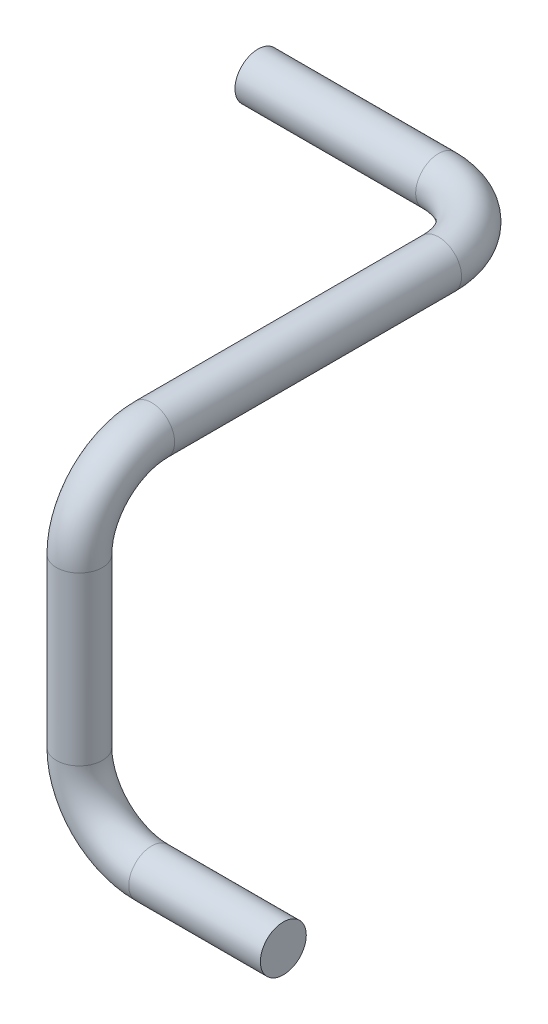
ISO-10303-21;
HEADER;
FILE_DESCRIPTION(('STEP AP214'),'2;1');
FILE_NAME('part.step','',(''),(''),'','','');
FILE_SCHEMA(('AUTOMOTIVE_DESIGN { 1 0 10303 214 1 1 1 1 }'));
ENDSEC;
DATA;
#1=APPLICATION_CONTEXT('core data for automotive mechanical design processes');
#2=APPLICATION_PROTOCOL_DEFINITION('international standard','automotive_design',2000,#1);
#3=PRODUCT_CONTEXT('',#1,'mechanical');
#4=PRODUCT('Part','Part','',(#3));
#5=PRODUCT_RELATED_PRODUCT_CATEGORY('part','',(#4));
#6=PRODUCT_DEFINITION_FORMATION('','',#4);
#7=PRODUCT_DEFINITION_CONTEXT('part definition',#1,'design');
#8=PRODUCT_DEFINITION('design','',#6,#7);
#9=PRODUCT_DEFINITION_SHAPE('','',#8);
#10=(LENGTH_UNIT() NAMED_UNIT(*) SI_UNIT(.MILLI.,.METRE.));
#11=(NAMED_UNIT(*) PLANE_ANGLE_UNIT() SI_UNIT($,.RADIAN.));
#12=(NAMED_UNIT(*) SI_UNIT($,.STERADIAN.) SOLID_ANGLE_UNIT());
#13=UNCERTAINTY_MEASURE_WITH_UNIT(LENGTH_MEASURE(1.E-05),#10,'distance_accuracy_value','');
#14=(GEOMETRIC_REPRESENTATION_CONTEXT(3) GLOBAL_UNCERTAINTY_ASSIGNED_CONTEXT((#13)) GLOBAL_UNIT_ASSIGNED_CONTEXT((#10,
#11,#12)) REPRESENTATION_CONTEXT('',''));
#15=CARTESIAN_POINT('',(0.,0.,0.));
#16=DIRECTION('',(0.,0.,1.));
#17=DIRECTION('',(1.,0.,0.));
#18=AXIS2_PLACEMENT_3D('',#15,#16,#17);
#19=CARTESIAN_POINT('',(70.,0.,20.));
#20=DIRECTION('',(0.,0.,1.));
#21=DIRECTION('',(1.,0.,0.));
#22=AXIS2_PLACEMENT_3D('',#19,#20,#21);
#23=CYLINDRICAL_SURFACE('',#22,6.35);
#24=CARTESIAN_POINT('',(70.,0.,20.));
#25=DIRECTION('',(0.,0.,1.));
#26=DIRECTION('',(1.,0.,0.));
#27=AXIS2_PLACEMENT_3D('',#24,#25,#26);
#28=CIRCLE('',#27,6.35);
#29=CARTESIAN_POINT('',(76.35,0.,20.));
#30=VERTEX_POINT('',#29);
#31=EDGE_CURVE('E10',#30,#30,#28,.T.);
#32=ORIENTED_EDGE('',*,*,#31,.T.);
#33=EDGE_LOOP('',(#32));
#34=FACE_BOUND('',#33,.T.);
#35=CARTESIAN_POINT('',(70.,0.,99.3877878972387));
#36=DIRECTION('',(0.,0.,1.));
#37=DIRECTION('',(1.,0.,0.));
#38=AXIS2_PLACEMENT_3D('',#35,#36,#37);
#39=CIRCLE('',#38,6.35);
#40=CARTESIAN_POINT('',(70.,6.35,99.3877878972387));
#41=VERTEX_POINT('',#40);
#42=EDGE_CURVE('E50',#41,#41,#39,.T.);
#43=ORIENTED_EDGE('',*,*,#42,.F.);
#44=EDGE_LOOP('',(#43));
#45=FACE_BOUND('',#44,.T.);
#46=ADVANCED_FACE('F31',(#34,#45),#23,.T.);
#47=CARTESIAN_POINT('',(50.,0.,20.));
#48=DIRECTION('',(0.,-1.,0.));
#49=DIRECTION('',(0.,0.,-1.));
#50=AXIS2_PLACEMENT_3D('',#47,#48,#49);
#51=TOROIDAL_SURFACE('',#50,20.,6.35);
#52=CARTESIAN_POINT('',(50.,0.,0.));
#53=DIRECTION('',(1.,0.,0.));
#54=DIRECTION('',(0.,0.,-1.));
#55=AXIS2_PLACEMENT_3D('',#52,#53,#54);
#56=CIRCLE('',#55,6.35);
#57=CARTESIAN_POINT('',(50.,0.,-6.35));
#58=VERTEX_POINT('',#57);
#59=EDGE_CURVE('E37',#58,#58,#56,.T.);
#60=CARTESIAN_POINT('',(50.,0.,20.));
#61=DIRECTION('',(0.,-1.,0.));
#62=DIRECTION('',(0.,0.,-1.));
#63=AXIS2_PLACEMENT_3D('',#60,#61,#62);
#64=CIRCLE('',#63,26.35);
#65=EDGE_CURVE('',#58,#30,#64,.T.);
#66=ORIENTED_EDGE('',*,*,#59,.T.);
#67=ORIENTED_EDGE('',*,*,#31,.F.);
#68=ORIENTED_EDGE('',*,*,#65,.T.);
#69=ORIENTED_EDGE('',*,*,#65,.F.);
#70=EDGE_LOOP('',(#66,#68,#67,#69));
#71=FACE_BOUND('',#70,.T.);
#72=ADVANCED_FACE('F83',(#71),#51,.T.);
#73=CARTESIAN_POINT('',(50.,0.,0.));
#74=DIRECTION('',(-1.,0.,0.));
#75=DIRECTION('',(0.,0.,1.));
#76=AXIS2_PLACEMENT_3D('',#73,#74,#75);
#77=CYLINDRICAL_SURFACE('',#76,6.35);
#78=ORIENTED_EDGE('',*,*,#59,.F.);
#79=EDGE_LOOP('',(#78));
#80=FACE_BOUND('',#79,.T.);
#81=CARTESIAN_POINT('',(0.,0.,0.));
#82=DIRECTION('',(1.,0.,0.));
#83=DIRECTION('',(0.,0.,-1.));
#84=AXIS2_PLACEMENT_3D('',#81,#82,#83);
#85=CIRCLE('',#84,6.35);
#86=CARTESIAN_POINT('',(0.,0.,-6.35));
#87=VERTEX_POINT('',#86);
#88=EDGE_CURVE('E41',#87,#87,#85,.T.);
#89=ORIENTED_EDGE('',*,*,#88,.T.);
#90=EDGE_LOOP('',(#89));
#91=FACE_BOUND('',#90,.T.);
#92=ADVANCED_FACE('F79',(#80,#91),#77,.T.);
#93=CARTESIAN_POINT('',(0.,0.,0.));
#94=DIRECTION('',(1.,0.,0.));
#95=DIRECTION('',(0.,0.,-1.));
#96=AXIS2_PLACEMENT_3D('',#93,#94,#95);
#97=PLANE('',#96);
#98=ORIENTED_EDGE('',*,*,#88,.F.);
#99=EDGE_LOOP('',(#98));
#100=FACE_BOUND('',#99,.T.);
#101=ADVANCED_FACE('F69',(#100),#97,.F.);
#102=CARTESIAN_POINT('',(70.,-20.,119.387787897239));
#103=DIRECTION('',(0.,-1.,0.));
#104=DIRECTION('',(0.,0.,-1.));
#105=AXIS2_PLACEMENT_3D('',#102,#103,#104);
#106=CYLINDRICAL_SURFACE('',#105,6.35);
#107=CARTESIAN_POINT('',(70.,-20.,119.387787897239));
#108=DIRECTION('',(0.,-1.,0.));
#109=DIRECTION('',(1.,0.,0.));
#110=AXIS2_PLACEMENT_3D('',#107,#108,#109);
#111=CIRCLE('',#110,6.35);
#112=CARTESIAN_POINT('',(70.,-20.,125.737787897239));
#113=VERTEX_POINT('',#112);
#114=EDGE_CURVE('E46',#113,#113,#111,.T.);
#115=ORIENTED_EDGE('',*,*,#114,.T.);
#116=EDGE_LOOP('',(#115));
#117=FACE_BOUND('',#116,.T.);
#118=CARTESIAN_POINT('',(70.,-66.211244978734,119.387787897239));
#119=DIRECTION('',(0.,-1.,0.));
#120=DIRECTION('',(0.,0.,-1.));
#121=AXIS2_PLACEMENT_3D('',#118,#119,#120);
#122=CIRCLE('',#121,6.34999999999999);
#123=CARTESIAN_POINT('',(63.65,-66.211244978734,119.387787897239));
#124=VERTEX_POINT('',#123);
#125=EDGE_CURVE('E59',#124,#124,#122,.T.);
#126=ORIENTED_EDGE('',*,*,#125,.F.);
#127=EDGE_LOOP('',(#126));
#128=FACE_BOUND('',#127,.T.);
#129=ADVANCED_FACE('F66',(#117,#128),#106,.T.);
#130=CARTESIAN_POINT('',(70.,-20.,99.3877878972387));
#131=DIRECTION('',(1.,0.,0.));
#132=DIRECTION('',(0.,0.,-1.));
#133=AXIS2_PLACEMENT_3D('',#130,#131,#132);
#134=TOROIDAL_SURFACE('',#133,20.,6.35);
#135=CARTESIAN_POINT('',(70.,-20.,99.3877878972387));
#136=DIRECTION('',(1.,0.,0.));
#137=DIRECTION('',(0.,0.,-1.));
#138=AXIS2_PLACEMENT_3D('',#135,#136,#137);
#139=CIRCLE('',#138,26.35);
#140=EDGE_CURVE('',#41,#113,#139,.T.);
#141=ORIENTED_EDGE('',*,*,#42,.T.);
#142=ORIENTED_EDGE('',*,*,#114,.F.);
#143=ORIENTED_EDGE('',*,*,#140,.T.);
#144=ORIENTED_EDGE('',*,*,#140,.F.);
#145=EDGE_LOOP('',(#141,#143,#142,#144));
#146=FACE_BOUND('',#145,.T.);
#147=ADVANCED_FACE('F68',(#146),#134,.T.);
#148=CARTESIAN_POINT('',(90.,-86.211244978734,119.387787897239));
#149=DIRECTION('',(1.,0.,0.));
#150=DIRECTION('',(0.,1.,0.));
#151=AXIS2_PLACEMENT_3D('',#148,#149,#150);
#152=CYLINDRICAL_SURFACE('',#151,6.34999999999999);
#153=CARTESIAN_POINT('',(90.,-86.211244978734,119.387787897239));
#154=DIRECTION('',(1.,0.,0.));
#155=DIRECTION('',(0.,0.,-1.));
#156=AXIS2_PLACEMENT_3D('',#153,#154,#155);
#157=CIRCLE('',#156,6.34999999999999);
#158=CARTESIAN_POINT('',(90.,-92.561244978734,119.387787897239));
#159=VERTEX_POINT('',#158);
#160=EDGE_CURVE('E56',#159,#159,#157,.T.);
#161=ORIENTED_EDGE('',*,*,#160,.T.);
#162=EDGE_LOOP('',(#161));
#163=FACE_BOUND('',#162,.T.);
#164=CARTESIAN_POINT('',(126.422073060206,-86.2112449787339,119.387787897239));
#165=DIRECTION('',(1.,0.,0.));
#166=DIRECTION('',(0.,0.,-1.));
#167=AXIS2_PLACEMENT_3D('',#164,#165,#166);
#168=CIRCLE('',#167,6.34999999999999);
#169=CARTESIAN_POINT('',(126.422073060206,-86.2112449787339,113.037787897239));
#170=VERTEX_POINT('',#169);
#171=EDGE_CURVE('E53',#170,#170,#168,.T.);
#172=ORIENTED_EDGE('',*,*,#171,.F.);
#173=EDGE_LOOP('',(#172));
#174=FACE_BOUND('',#173,.T.);
#175=ADVANCED_FACE('F76',(#163,#174),#152,.T.);
#176=CARTESIAN_POINT('',(90.,-66.211244978734,119.387787897239));
#177=DIRECTION('',(0.,0.,1.));
#178=DIRECTION('',(1.,0.,0.));
#179=AXIS2_PLACEMENT_3D('',#176,#177,#178);
#180=TOROIDAL_SURFACE('',#179,20.,6.34999999999999);
#181=CARTESIAN_POINT('',(90.,-66.211244978734,119.387787897239));
#182=DIRECTION('',(0.,0.,1.));
#183=DIRECTION('',(1.,0.,0.));
#184=AXIS2_PLACEMENT_3D('',#181,#182,#183);
#185=CIRCLE('',#184,26.35);
#186=EDGE_CURVE('',#124,#159,#185,.T.);
#187=ORIENTED_EDGE('',*,*,#125,.T.);
#188=ORIENTED_EDGE('',*,*,#160,.F.);
#189=ORIENTED_EDGE('',*,*,#186,.T.);
#190=ORIENTED_EDGE('',*,*,#186,.F.);
#191=EDGE_LOOP('',(#187,#189,#188,#190));
#192=FACE_BOUND('',#191,.T.);
#193=ADVANCED_FACE('F63',(#192),#180,.T.);
#194=CARTESIAN_POINT('',(126.422073060206,-86.2112449787339,119.387787897239));
#195=DIRECTION('',(1.,0.,0.));
#196=DIRECTION('',(0.,0.,-1.));
#197=AXIS2_PLACEMENT_3D('',#194,#195,#196);
#198=PLANE('',#197);
#199=ORIENTED_EDGE('',*,*,#171,.T.);
#200=EDGE_LOOP('',(#199));
#201=FACE_BOUND('',#200,.T.);
#202=ADVANCED_FACE('F140',(#201),#198,.T.);
#203=CLOSED_SHELL('',(#46,#72,#92,#101,#129,#147,#175,#193,#202));
#204=MANIFOLD_SOLID_BREP('B2',#203);
#205=ADVANCED_BREP_SHAPE_REPRESENTATION('',(#18,#204),#14);
#206=SHAPE_DEFINITION_REPRESENTATION(#9,#205);
ENDSEC;
END-ISO-10303-21;
